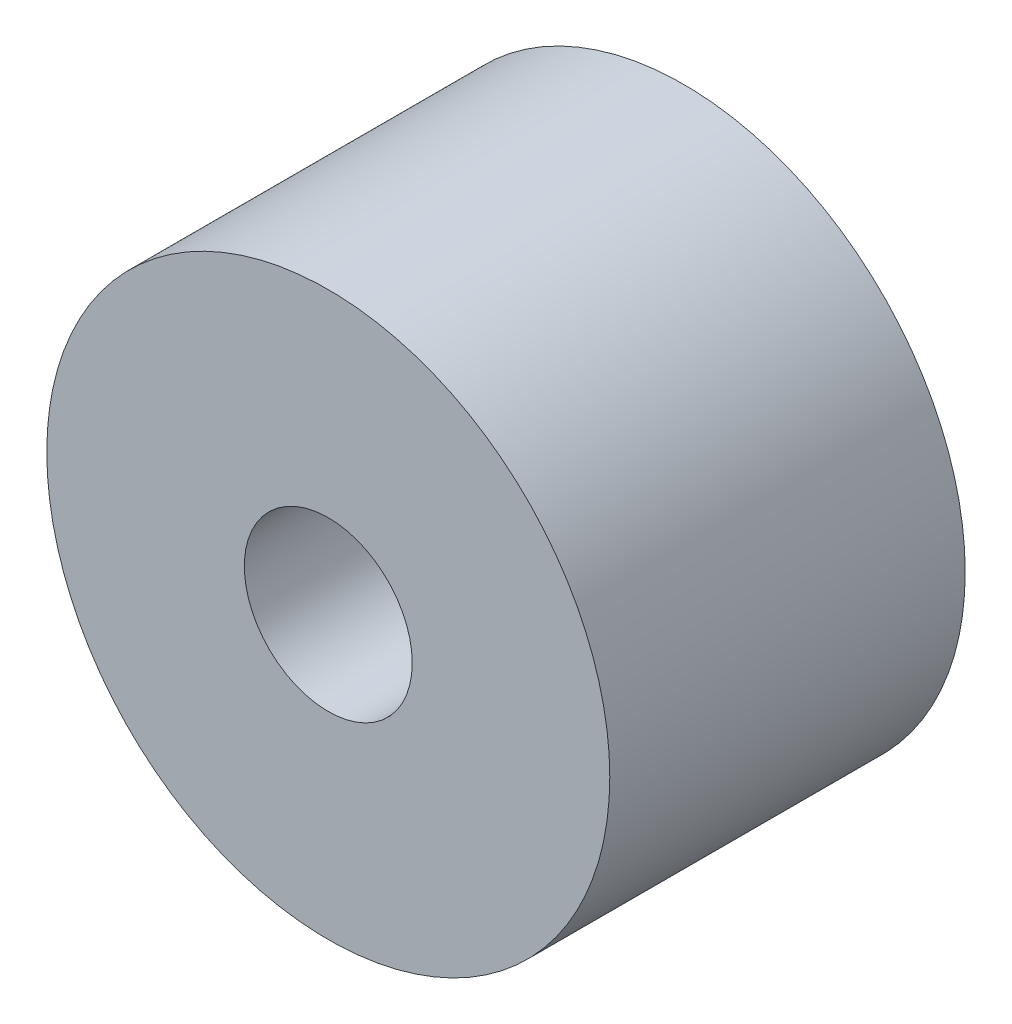
ISO-10303-21;
HEADER;
FILE_DESCRIPTION(('STEP AP214'),'2;1');
FILE_NAME('part.step','',(''),(''),'','','');
FILE_SCHEMA(('AUTOMOTIVE_DESIGN { 1 0 10303 214 1 1 1 1 }'));
ENDSEC;
DATA;
#1=APPLICATION_CONTEXT('core data for automotive mechanical design processes');
#2=APPLICATION_PROTOCOL_DEFINITION('international standard','automotive_design',2000,#1);
#3=PRODUCT_CONTEXT('',#1,'mechanical');
#4=PRODUCT('Part','Part','',(#3));
#5=PRODUCT_RELATED_PRODUCT_CATEGORY('part','',(#4));
#6=PRODUCT_DEFINITION_FORMATION('','',#4);
#7=PRODUCT_DEFINITION_CONTEXT('part definition',#1,'design');
#8=PRODUCT_DEFINITION('design','',#6,#7);
#9=PRODUCT_DEFINITION_SHAPE('','',#8);
#10=(LENGTH_UNIT() NAMED_UNIT(*) SI_UNIT(.MILLI.,.METRE.));
#11=(NAMED_UNIT(*) PLANE_ANGLE_UNIT() SI_UNIT($,.RADIAN.));
#12=(NAMED_UNIT(*) SI_UNIT($,.STERADIAN.) SOLID_ANGLE_UNIT());
#13=UNCERTAINTY_MEASURE_WITH_UNIT(LENGTH_MEASURE(1.E-05),#10,'distance_accuracy_value','');
#14=(GEOMETRIC_REPRESENTATION_CONTEXT(3) GLOBAL_UNCERTAINTY_ASSIGNED_CONTEXT((#13)) GLOBAL_UNIT_ASSIGNED_CONTEXT((#10,
#11,#12)) REPRESENTATION_CONTEXT('',''));
#15=CARTESIAN_POINT('',(0.,0.,0.));
#16=DIRECTION('',(0.,0.,1.));
#17=DIRECTION('',(1.,0.,0.));
#18=AXIS2_PLACEMENT_3D('',#15,#16,#17);
#19=CARTESIAN_POINT('',(0.,0.,12.7));
#20=DIRECTION('',(0.,0.,1.));
#21=DIRECTION('',(1.,0.,0.));
#22=AXIS2_PLACEMENT_3D('',#19,#20,#21);
#23=PLANE('',#22);
#24=CARTESIAN_POINT('',(0.,0.,12.7));
#25=DIRECTION('',(0.,0.,1.));
#26=DIRECTION('',(1.,0.,0.));
#27=AXIS2_PLACEMENT_3D('',#24,#25,#26);
#28=CIRCLE('',#27,10.0584);
#29=CARTESIAN_POINT('',(10.0584,0.,12.7));
#30=VERTEX_POINT('',#29);
#31=EDGE_CURVE('E10',#30,#30,#28,.T.);
#32=ORIENTED_EDGE('',*,*,#31,.T.);
#33=EDGE_LOOP('',(#32));
#34=FACE_BOUND('',#33,.T.);
#35=CARTESIAN_POINT('',(0.,0.,12.7));
#36=DIRECTION('',(0.,0.,1.));
#37=DIRECTION('',(1.,0.,0.));
#38=AXIS2_PLACEMENT_3D('',#35,#36,#37);
#39=CIRCLE('',#38,3.);
#40=CARTESIAN_POINT('',(3.,0.,12.7));
#41=VERTEX_POINT('',#40);
#42=EDGE_CURVE('E42',#41,#41,#39,.T.);
#43=ORIENTED_EDGE('',*,*,#42,.F.);
#44=EDGE_LOOP('',(#43));
#45=FACE_BOUND('',#44,.T.);
#46=ADVANCED_FACE('F31',(#34,#45),#23,.T.);
#47=CARTESIAN_POINT('',(0.,0.,0.));
#48=DIRECTION('',(0.,0.,1.));
#49=DIRECTION('',(1.,0.,0.));
#50=AXIS2_PLACEMENT_3D('',#47,#48,#49);
#51=PLANE('',#50);
#52=CARTESIAN_POINT('',(0.,0.,0.));
#53=DIRECTION('',(0.,0.,1.));
#54=DIRECTION('',(1.,0.,0.));
#55=AXIS2_PLACEMENT_3D('',#52,#53,#54);
#56=CIRCLE('',#55,10.0584);
#57=CARTESIAN_POINT('',(10.0584,0.,0.));
#58=VERTEX_POINT('',#57);
#59=EDGE_CURVE('E35',#58,#58,#56,.T.);
#60=ORIENTED_EDGE('',*,*,#59,.F.);
#61=EDGE_LOOP('',(#60));
#62=FACE_BOUND('',#61,.T.);
#63=CARTESIAN_POINT('',(0.,0.,0.));
#64=DIRECTION('',(0.,0.,1.));
#65=DIRECTION('',(1.,0.,0.));
#66=AXIS2_PLACEMENT_3D('',#63,#64,#65);
#67=CIRCLE('',#66,3.);
#68=CARTESIAN_POINT('',(3.,0.,0.));
#69=VERTEX_POINT('',#68);
#70=EDGE_CURVE('E44',#69,#69,#67,.T.);
#71=ORIENTED_EDGE('',*,*,#70,.T.);
#72=EDGE_LOOP('',(#71));
#73=FACE_BOUND('',#72,.T.);
#74=ADVANCED_FACE('F54',(#62,#73),#51,.F.);
#75=CARTESIAN_POINT('',(0.,0.,12.7));
#76=DIRECTION('',(0.,0.,-1.));
#77=DIRECTION('',(-1.,0.,0.));
#78=AXIS2_PLACEMENT_3D('',#75,#76,#77);
#79=CYLINDRICAL_SURFACE('',#78,10.0584);
#80=ORIENTED_EDGE('',*,*,#31,.F.);
#81=EDGE_LOOP('',(#80));
#82=FACE_BOUND('',#81,.T.);
#83=ORIENTED_EDGE('',*,*,#59,.T.);
#84=EDGE_LOOP('',(#83));
#85=FACE_BOUND('',#84,.T.);
#86=ADVANCED_FACE('F33',(#82,#85),#79,.T.);
#87=CARTESIAN_POINT('',(0.,0.,12.7));
#88=DIRECTION('',(0.,0.,-1.));
#89=DIRECTION('',(-1.,0.,0.));
#90=AXIS2_PLACEMENT_3D('',#87,#88,#89);
#91=CYLINDRICAL_SURFACE('',#90,3.);
#92=ORIENTED_EDGE('',*,*,#42,.T.);
#93=EDGE_LOOP('',(#92));
#94=FACE_BOUND('',#93,.T.);
#95=ORIENTED_EDGE('',*,*,#70,.F.);
#96=EDGE_LOOP('',(#95));
#97=FACE_BOUND('',#96,.T.);
#98=ADVANCED_FACE('F50',(#94,#97),#91,.F.);
#99=CLOSED_SHELL('',(#46,#74,#86,#98));
#100=MANIFOLD_SOLID_BREP('B2',#99);
#101=ADVANCED_BREP_SHAPE_REPRESENTATION('',(#18,#100),#14);
#102=SHAPE_DEFINITION_REPRESENTATION(#9,#101);
ENDSEC;
END-ISO-10303-21;
